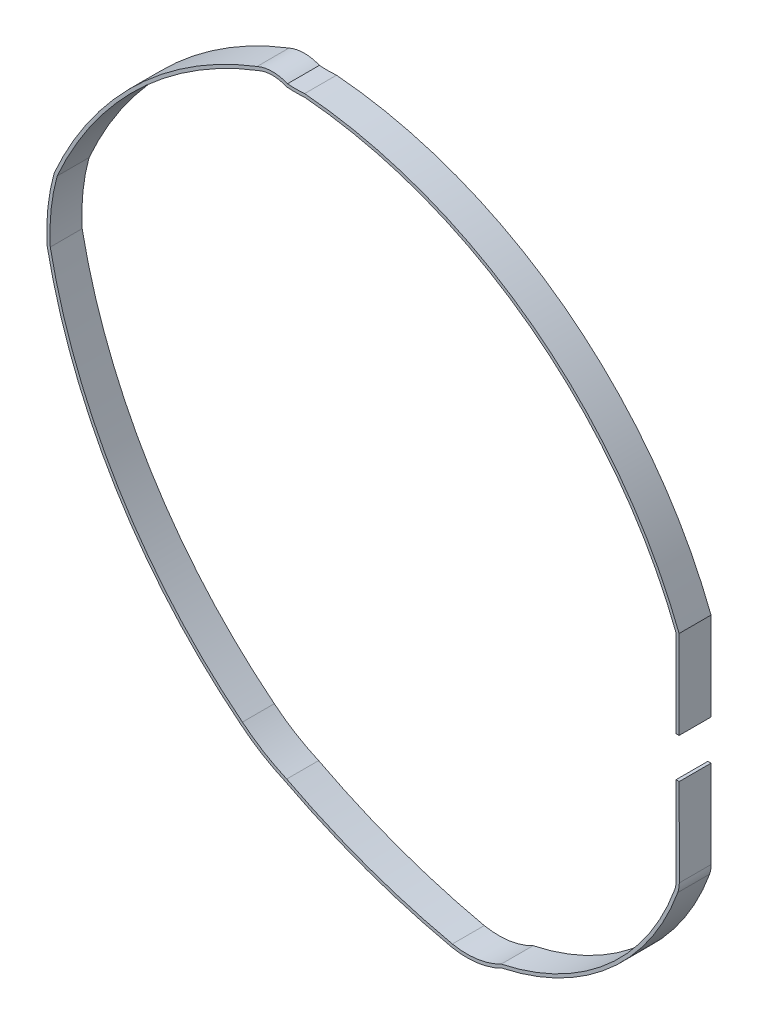
ISO-10303-21;
HEADER;
FILE_DESCRIPTION(('STEP AP214'),'2;1');
FILE_NAME('part.step','',(''),(''),'','','');
FILE_SCHEMA(('AUTOMOTIVE_DESIGN { 1 0 10303 214 1 1 1 1 }'));
ENDSEC;
DATA;
#1=APPLICATION_CONTEXT('core data for automotive mechanical design processes');
#2=APPLICATION_PROTOCOL_DEFINITION('international standard','automotive_design',2000,#1);
#3=PRODUCT_CONTEXT('',#1,'mechanical');
#4=PRODUCT('Part','Part','',(#3));
#5=PRODUCT_RELATED_PRODUCT_CATEGORY('part','',(#4));
#6=PRODUCT_DEFINITION_FORMATION('','',#4);
#7=PRODUCT_DEFINITION_CONTEXT('part definition',#1,'design');
#8=PRODUCT_DEFINITION('design','',#6,#7);
#9=PRODUCT_DEFINITION_SHAPE('','',#8);
#10=(LENGTH_UNIT() NAMED_UNIT(*) SI_UNIT(.MILLI.,.METRE.));
#11=(NAMED_UNIT(*) PLANE_ANGLE_UNIT() SI_UNIT($,.RADIAN.));
#12=(NAMED_UNIT(*) SI_UNIT($,.STERADIAN.) SOLID_ANGLE_UNIT());
#13=UNCERTAINTY_MEASURE_WITH_UNIT(LENGTH_MEASURE(1.E-05),#10,'distance_accuracy_value','');
#14=(GEOMETRIC_REPRESENTATION_CONTEXT(3) GLOBAL_UNCERTAINTY_ASSIGNED_CONTEXT((#13)) GLOBAL_UNIT_ASSIGNED_CONTEXT((#10,
#11,#12)) REPRESENTATION_CONTEXT('',''));
#15=CARTESIAN_POINT('',(0.,0.,0.));
#16=DIRECTION('',(0.,0.,1.));
#17=DIRECTION('',(1.,0.,0.));
#18=AXIS2_PLACEMENT_3D('',#15,#16,#17);
#19=CARTESIAN_POINT('',(32.2426542166612,-64.1730551396362,4.));
#20=DIRECTION('',(-0.999999306327988,-0.00117785548448811,0.));
#21=DIRECTION('',(0.00117785548448811,-0.999999306327988,0.));
#22=AXIS2_PLACEMENT_3D('',#19,#20,#21);
#23=PLANE('',#22);
#24=DIRECTION('',(-0.00117785548448811,0.999999306327988,0.));
#25=VECTOR('',#24,1.);
#26=CARTESIAN_POINT('',(32.2426542166612,-64.1730551396362,0.));
#27=LINE('',#26,#25);
#28=CARTESIAN_POINT('',(32.2426542166612,-64.1730551396362,0.));
#29=VERTEX_POINT('',#28);
#30=CARTESIAN_POINT('',(32.2296978063318,-53.1730627700283,0.));
#31=VERTEX_POINT('',#30);
#32=EDGE_CURVE('E248',#29,#31,#27,.T.);
#33=ORIENTED_EDGE('',*,*,#32,.T.);
#34=DIRECTION('',(0.,0.,-1.));
#35=VECTOR('',#34,1.);
#36=CARTESIAN_POINT('',(32.2296978063318,-53.1730627700283,4.));
#37=LINE('',#36,#35);
#38=CARTESIAN_POINT('',(32.2296978063318,-53.1730627700283,4.));
#39=VERTEX_POINT('',#38);
#40=EDGE_CURVE('E11',#39,#31,#37,.T.);
#41=ORIENTED_EDGE('',*,*,#40,.F.);
#42=DIRECTION('',(-0.00117785548448811,0.999999306327988,0.));
#43=VECTOR('',#42,1.);
#44=CARTESIAN_POINT('',(32.2426542166612,-64.1730551396362,4.));
#45=LINE('',#44,#43);
#46=CARTESIAN_POINT('',(32.2426542166612,-64.1730551396362,4.));
#47=VERTEX_POINT('',#46);
#48=EDGE_CURVE('E149',#47,#39,#45,.T.);
#49=ORIENTED_EDGE('',*,*,#48,.F.);
#50=DIRECTION('',(0.,0.,-1.));
#51=VECTOR('',#50,1.);
#52=CARTESIAN_POINT('',(32.2426542166612,-64.1730551396362,4.));
#53=LINE('',#52,#51);
#54=EDGE_CURVE('E244',#47,#29,#53,.T.);
#55=ORIENTED_EDGE('',*,*,#54,.T.);
#56=EDGE_LOOP('',(#33,#41,#49,#55));
#57=FACE_BOUND('',#56,.T.);
#58=ADVANCED_FACE('F33',(#57),#23,.F.);
#59=CARTESIAN_POINT('',(31.8296980838006,-53.1735339122221,4.));
#60=DIRECTION('',(-0.00117785548450073,0.999999306327988,0.));
#61=DIRECTION('',(-0.999999306327988,-0.00117785548450073,0.));
#62=AXIS2_PLACEMENT_3D('',#59,#60,#61);
#63=PLANE('',#62);
#64=DIRECTION('',(0.999999306327988,0.00117785548450073,0.));
#65=VECTOR('',#64,1.);
#66=CARTESIAN_POINT('',(31.8296980838006,-53.1735339122221,0.));
#67=LINE('',#66,#65);
#68=CARTESIAN_POINT('',(31.8296980838006,-53.1735339122221,0.));
#69=VERTEX_POINT('',#68);
#70=EDGE_CURVE('E251',#69,#31,#67,.T.);
#71=ORIENTED_EDGE('',*,*,#70,.F.);
#72=DIRECTION('',(0.,0.,-1.));
#73=VECTOR('',#72,1.);
#74=CARTESIAN_POINT('',(31.8296980838006,-53.1735339122221,4.));
#75=LINE('',#74,#73);
#76=CARTESIAN_POINT('',(31.8296980838006,-53.1735339122221,4.));
#77=VERTEX_POINT('',#76);
#78=EDGE_CURVE('E41',#77,#69,#75,.T.);
#79=ORIENTED_EDGE('',*,*,#78,.F.);
#80=DIRECTION('',(0.999999306327988,0.00117785548450073,0.));
#81=VECTOR('',#80,1.);
#82=CARTESIAN_POINT('',(31.8296980838006,-53.1735339122221,4.));
#83=LINE('',#82,#81);
#84=EDGE_CURVE('E393',#77,#39,#83,.T.);
#85=ORIENTED_EDGE('',*,*,#84,.T.);
#86=ORIENTED_EDGE('',*,*,#40,.T.);
#87=EDGE_LOOP('',(#71,#79,#85,#86));
#88=FACE_BOUND('',#87,.T.);
#89=ADVANCED_FACE('F380',(#88),#63,.T.);
#90=CARTESIAN_POINT('',(31.84265449413,-64.17352628183,4.));
#91=DIRECTION('',(-0.999999306327988,-0.00117785548448811,0.));
#92=DIRECTION('',(0.00117785548448811,-0.999999306327988,0.));
#93=AXIS2_PLACEMENT_3D('',#90,#91,#92);
#94=PLANE('',#93);
#95=DIRECTION('',(-0.00117785548448811,0.999999306327988,0.));
#96=VECTOR('',#95,1.);
#97=CARTESIAN_POINT('',(31.84265449413,-64.17352628183,0.));
#98=LINE('',#97,#96);
#99=CARTESIAN_POINT('',(31.84265449413,-64.17352628183,0.));
#100=VERTEX_POINT('',#99);
#101=EDGE_CURVE('E254',#100,#69,#98,.T.);
#102=ORIENTED_EDGE('',*,*,#101,.F.);
#103=DIRECTION('',(0.,0.,-1.));
#104=VECTOR('',#103,1.);
#105=CARTESIAN_POINT('',(31.84265449413,-64.17352628183,4.));
#106=LINE('',#105,#104);
#107=CARTESIAN_POINT('',(31.84265449413,-64.17352628183,4.));
#108=VERTEX_POINT('',#107);
#109=EDGE_CURVE('E370',#108,#100,#106,.T.);
#110=ORIENTED_EDGE('',*,*,#109,.F.);
#111=DIRECTION('',(-0.00117785548448811,0.999999306327988,0.));
#112=VECTOR('',#111,1.);
#113=CARTESIAN_POINT('',(31.84265449413,-64.17352628183,4.));
#114=LINE('',#113,#112);
#115=EDGE_CURVE('E377',#108,#77,#114,.T.);
#116=ORIENTED_EDGE('',*,*,#115,.T.);
#117=ORIENTED_EDGE('',*,*,#78,.T.);
#118=EDGE_LOOP('',(#102,#110,#116,#117));
#119=FACE_BOUND('',#118,.T.);
#120=ADVANCED_FACE('F375',(#119),#94,.T.);
#121=CARTESIAN_POINT('',(28.8426565751458,-64.1770598482834,4.));
#122=DIRECTION('',(0.,0.,-1.));
#123=DIRECTION('',(-1.,0.,0.));
#124=AXIS2_PLACEMENT_3D('',#121,#122,#123);
#125=CYLINDRICAL_SURFACE('',#124,3.00000000000022);
#126=CARTESIAN_POINT('',(28.8426565751458,-64.1770598482834,0.));
#127=DIRECTION('',(0.,0.,1.));
#128=DIRECTION('',(-1.,0.,0.));
#129=AXIS2_PLACEMENT_3D('',#126,#127,#128);
#130=CIRCLE('',#129,3.00000000000022);
#131=CARTESIAN_POINT('',(31.6649801349229,-65.1941585278267,0.));
#132=VERTEX_POINT('',#131);
#133=EDGE_CURVE('E257',#132,#100,#130,.T.);
#134=ORIENTED_EDGE('',*,*,#133,.F.);
#135=DIRECTION('',(0.,0.,-1.));
#136=VECTOR('',#135,1.);
#137=CARTESIAN_POINT('',(31.6649801349229,-65.1941585278267,4.));
#138=LINE('',#137,#136);
#139=CARTESIAN_POINT('',(31.6649801349229,-65.1941585278267,4.));
#140=VERTEX_POINT('',#139);
#141=EDGE_CURVE('E368',#140,#132,#138,.T.);
#142=ORIENTED_EDGE('',*,*,#141,.F.);
#143=CARTESIAN_POINT('',(28.8426565751458,-64.1770598482834,4.));
#144=DIRECTION('',(0.,0.,1.));
#145=DIRECTION('',(-1.,0.,0.));
#146=AXIS2_PLACEMENT_3D('',#143,#144,#145);
#147=CIRCLE('',#146,3.00000000000022);
#148=EDGE_CURVE('E390',#140,#108,#147,.T.);
#149=ORIENTED_EDGE('',*,*,#148,.T.);
#150=ORIENTED_EDGE('',*,*,#109,.T.);
#151=EDGE_LOOP('',(#134,#142,#149,#150));
#152=FACE_BOUND('',#151,.T.);
#153=ADVANCED_FACE('F387',(#152),#125,.F.);
#154=CARTESIAN_POINT('',(3.75255400761759,-55.1351801167282,4.));
#155=DIRECTION('',(0.,0.,-1.));
#156=DIRECTION('',(-1.,0.,0.));
#157=AXIS2_PLACEMENT_3D('',#154,#155,#156);
#158=CYLINDRICAL_SURFACE('',#157,29.6696238430355);
#159=CARTESIAN_POINT('',(3.75255400761759,-55.1351801167282,0.));
#160=DIRECTION('',(0.,0.,1.));
#161=DIRECTION('',(-1.,0.,0.));
#162=AXIS2_PLACEMENT_3D('',#159,#160,#161);
#163=CIRCLE('',#162,29.6696238430355);
#164=CARTESIAN_POINT('',(9.91256322862572,-84.158289277952,0.));
#165=VERTEX_POINT('',#164);
#166=EDGE_CURVE('E260',#165,#132,#163,.T.);
#167=ORIENTED_EDGE('',*,*,#166,.F.);
#168=DIRECTION('',(0.,0.,-1.));
#169=VECTOR('',#168,1.);
#170=CARTESIAN_POINT('',(9.91256322862572,-84.158289277952,4.));
#171=LINE('',#170,#169);
#172=CARTESIAN_POINT('',(9.91256322862572,-84.158289277952,4.));
#173=VERTEX_POINT('',#172);
#174=EDGE_CURVE('E366',#173,#165,#171,.T.);
#175=ORIENTED_EDGE('',*,*,#174,.F.);
#176=CARTESIAN_POINT('',(3.75255400761759,-55.1351801167282,4.));
#177=DIRECTION('',(0.,0.,1.));
#178=DIRECTION('',(-1.,0.,0.));
#179=AXIS2_PLACEMENT_3D('',#176,#177,#178);
#180=CIRCLE('',#179,29.6696238430355);
#181=EDGE_CURVE('E395',#173,#140,#180,.T.);
#182=ORIENTED_EDGE('',*,*,#181,.T.);
#183=ORIENTED_EDGE('',*,*,#141,.T.);
#184=EDGE_LOOP('',(#167,#175,#182,#183));
#185=FACE_BOUND('',#184,.T.);
#186=ADVANCED_FACE('F481',(#185),#158,.F.);
#187=CARTESIAN_POINT('',(5.60203262604722,-75.9039146753038,4.));
#188=DIRECTION('',(0.,0.,-1.));
#189=DIRECTION('',(-1.,0.,0.));
#190=AXIS2_PLACEMENT_3D('',#187,#188,#189);
#191=CYLINDRICAL_SURFACE('',#190,9.31210900691185);
#192=CARTESIAN_POINT('',(5.60203262604722,-75.9039146753038,0.));
#193=DIRECTION('',(0.,0.,1.));
#194=DIRECTION('',(1.,0.,0.));
#195=AXIS2_PLACEMENT_3D('',#192,#193,#194);
#196=CIRCLE('',#195,9.31210900691185);
#197=CARTESIAN_POINT('',(3.78571826090459,-85.0371712841803,0.));
#198=VERTEX_POINT('',#197);
#199=EDGE_CURVE('E263',#198,#165,#196,.T.);
#200=ORIENTED_EDGE('',*,*,#199,.F.);
#201=DIRECTION('',(0.,0.,-1.));
#202=VECTOR('',#201,1.);
#203=CARTESIAN_POINT('',(3.78571826090459,-85.0371712841803,4.));
#204=LINE('',#203,#202);
#205=CARTESIAN_POINT('',(3.78571826090459,-85.0371712841803,4.));
#206=VERTEX_POINT('',#205);
#207=EDGE_CURVE('E364',#206,#198,#204,.T.);
#208=ORIENTED_EDGE('',*,*,#207,.F.);
#209=CARTESIAN_POINT('',(5.60203262604722,-75.9039146753038,4.));
#210=DIRECTION('',(0.,0.,1.));
#211=DIRECTION('',(1.,0.,0.));
#212=AXIS2_PLACEMENT_3D('',#209,#210,#211);
#213=CIRCLE('',#212,9.31210900691185);
#214=EDGE_CURVE('E401',#206,#173,#213,.T.);
#215=ORIENTED_EDGE('',*,*,#214,.T.);
#216=ORIENTED_EDGE('',*,*,#174,.T.);
#217=EDGE_LOOP('',(#200,#208,#215,#216));
#218=FACE_BOUND('',#217,.T.);
#219=ADVANCED_FACE('F484',(#218),#191,.F.);
#220=CARTESIAN_POINT('',(21.6708654213609,-3.27432774122798,4.));
#221=DIRECTION('',(0.,0.,-1.));
#222=DIRECTION('',(-1.,0.,0.));
#223=AXIS2_PLACEMENT_3D('',#220,#221,#222);
#224=CYLINDRICAL_SURFACE('',#223,83.6961234059289);
#225=CARTESIAN_POINT('',(21.6708654213609,-3.27432774122798,0.));
#226=DIRECTION('',(0.,0.,1.));
#227=DIRECTION('',(1.,0.,0.));
#228=AXIS2_PLACEMENT_3D('',#225,#226,#227);
#229=CIRCLE('',#228,83.6961234059289);
#230=CARTESIAN_POINT('',(-16.9875040614568,-77.5075517188408,0.));
#231=VERTEX_POINT('',#230);
#232=EDGE_CURVE('E266',#231,#198,#229,.T.);
#233=ORIENTED_EDGE('',*,*,#232,.F.);
#234=DIRECTION('',(0.,0.,-1.));
#235=VECTOR('',#234,1.);
#236=CARTESIAN_POINT('',(-16.9875040614568,-77.5075517188408,4.));
#237=LINE('',#236,#235);
#238=CARTESIAN_POINT('',(-16.9875040614568,-77.5075517188408,4.));
#239=VERTEX_POINT('',#238);
#240=EDGE_CURVE('E362',#239,#231,#237,.T.);
#241=ORIENTED_EDGE('',*,*,#240,.F.);
#242=CARTESIAN_POINT('',(21.6708654213609,-3.27432774122798,4.));
#243=DIRECTION('',(0.,0.,1.));
#244=DIRECTION('',(1.,0.,0.));
#245=AXIS2_PLACEMENT_3D('',#242,#243,#244);
#246=CIRCLE('',#245,83.6961234059289);
#247=EDGE_CURVE('E404',#239,#206,#246,.T.);
#248=ORIENTED_EDGE('',*,*,#247,.T.);
#249=ORIENTED_EDGE('',*,*,#207,.T.);
#250=EDGE_LOOP('',(#233,#241,#248,#249));
#251=FACE_BOUND('',#250,.T.);
#252=ADVANCED_FACE('F488',(#251),#224,.F.);
#253=CARTESIAN_POINT('',(-7.53169654037676,-55.8267358830406,4.));
#254=DIRECTION('',(0.,0.,-1.));
#255=DIRECTION('',(-1.,0.,0.));
#256=AXIS2_PLACEMENT_3D('',#253,#254,#255);
#257=CYLINDRICAL_SURFACE('',#256,23.6531196923704);
#258=CARTESIAN_POINT('',(-7.53169654037676,-55.8267358830406,0.));
#259=DIRECTION('',(0.,0.,1.));
#260=DIRECTION('',(1.,0.,0.));
#261=AXIS2_PLACEMENT_3D('',#258,#259,#260);
#262=CIRCLE('',#261,23.6531196923704);
#263=CARTESIAN_POINT('',(-22.5433942410399,-74.1056582617122,0.));
#264=VERTEX_POINT('',#263);
#265=EDGE_CURVE('E269',#264,#231,#262,.T.);
#266=ORIENTED_EDGE('',*,*,#265,.F.);
#267=DIRECTION('',(0.,0.,-1.));
#268=VECTOR('',#267,1.);
#269=CARTESIAN_POINT('',(-22.5433942410399,-74.1056582617122,4.));
#270=LINE('',#269,#268);
#271=CARTESIAN_POINT('',(-22.5433942410399,-74.1056582617122,4.));
#272=VERTEX_POINT('',#271);
#273=EDGE_CURVE('E360',#272,#264,#270,.T.);
#274=ORIENTED_EDGE('',*,*,#273,.F.);
#275=CARTESIAN_POINT('',(-7.53169654037676,-55.8267358830406,4.));
#276=DIRECTION('',(0.,0.,1.));
#277=DIRECTION('',(1.,0.,0.));
#278=AXIS2_PLACEMENT_3D('',#275,#276,#277);
#279=CIRCLE('',#278,23.6531196923704);
#280=EDGE_CURVE('E407',#272,#239,#279,.T.);
#281=ORIENTED_EDGE('',*,*,#280,.T.);
#282=ORIENTED_EDGE('',*,*,#240,.T.);
#283=EDGE_LOOP('',(#266,#274,#281,#282));
#284=FACE_BOUND('',#283,.T.);
#285=ADVANCED_FACE('F492',(#284),#257,.F.);
#286=CARTESIAN_POINT('',(19.4934477611816,-21.3731292594592,4.));
#287=DIRECTION('',(0.,0.,-1.));
#288=DIRECTION('',(-1.,0.,0.));
#289=AXIS2_PLACEMENT_3D('',#286,#287,#288);
#290=CYLINDRICAL_SURFACE('',#289,67.4374947673265);
#291=CARTESIAN_POINT('',(19.4934477611816,-21.3731292594592,0.));
#292=DIRECTION('',(0.,0.,1.));
#293=DIRECTION('',(1.,0.,0.));
#294=AXIS2_PLACEMENT_3D('',#291,#292,#293);
#295=CIRCLE('',#294,67.4374947673265);
#296=CARTESIAN_POINT('',(-46.6407079031649,-34.5674141986737,0.));
#297=VERTEX_POINT('',#296);
#298=EDGE_CURVE('E272',#297,#264,#295,.T.);
#299=ORIENTED_EDGE('',*,*,#298,.F.);
#300=DIRECTION('',(0.,0.,-1.));
#301=VECTOR('',#300,1.);
#302=CARTESIAN_POINT('',(-46.6407079031649,-34.5674141986737,4.));
#303=LINE('',#302,#301);
#304=CARTESIAN_POINT('',(-46.6407079031649,-34.5674141986737,4.));
#305=VERTEX_POINT('',#304);
#306=EDGE_CURVE('E358',#305,#297,#303,.T.);
#307=ORIENTED_EDGE('',*,*,#306,.F.);
#308=CARTESIAN_POINT('',(19.4934477611816,-21.3731292594592,4.));
#309=DIRECTION('',(0.,0.,1.));
#310=DIRECTION('',(1.,0.,0.));
#311=AXIS2_PLACEMENT_3D('',#308,#309,#310);
#312=CIRCLE('',#311,67.4374947673265);
#313=EDGE_CURVE('E410',#305,#272,#312,.T.);
#314=ORIENTED_EDGE('',*,*,#313,.T.);
#315=ORIENTED_EDGE('',*,*,#273,.T.);
#316=EDGE_LOOP('',(#299,#307,#314,#315));
#317=FACE_BOUND('',#316,.T.);
#318=ADVANCED_FACE('F496',(#317),#290,.F.);
#319=CARTESIAN_POINT('',(-21.4883011659079,-33.1192294709946,4.));
#320=DIRECTION('',(0.,0.,-1.));
#321=DIRECTION('',(-1.,0.,0.));
#322=AXIS2_PLACEMENT_3D('',#319,#320,#321);
#323=CYLINDRICAL_SURFACE('',#322,25.1940628657209);
#324=CARTESIAN_POINT('',(-21.4883011659079,-33.1192294709946,0.));
#325=DIRECTION('',(0.,0.,1.));
#326=DIRECTION('',(1.,0.,0.));
#327=AXIS2_PLACEMENT_3D('',#324,#325,#326);
#328=CIRCLE('',#327,25.1940628657209);
#329=CARTESIAN_POINT('',(-45.7748927313331,-26.41831357717,0.));
#330=VERTEX_POINT('',#329);
#331=EDGE_CURVE('E275',#330,#297,#328,.T.);
#332=ORIENTED_EDGE('',*,*,#331,.F.);
#333=DIRECTION('',(0.,0.,-1.));
#334=VECTOR('',#333,1.);
#335=CARTESIAN_POINT('',(-45.7748927313331,-26.41831357717,4.));
#336=LINE('',#335,#334);
#337=CARTESIAN_POINT('',(-45.7748927313331,-26.41831357717,4.));
#338=VERTEX_POINT('',#337);
#339=EDGE_CURVE('E356',#338,#330,#336,.T.);
#340=ORIENTED_EDGE('',*,*,#339,.F.);
#341=CARTESIAN_POINT('',(-21.4883011659079,-33.1192294709946,4.));
#342=DIRECTION('',(0.,0.,1.));
#343=DIRECTION('',(1.,0.,0.));
#344=AXIS2_PLACEMENT_3D('',#341,#342,#343);
#345=CIRCLE('',#344,25.1940628657209);
#346=EDGE_CURVE('E413',#338,#305,#345,.T.);
#347=ORIENTED_EDGE('',*,*,#346,.T.);
#348=ORIENTED_EDGE('',*,*,#306,.T.);
#349=EDGE_LOOP('',(#332,#340,#347,#348));
#350=FACE_BOUND('',#349,.T.);
#351=ADVANCED_FACE('F500',(#350),#323,.F.);
#352=CARTESIAN_POINT('',(-4.26832410416488,-44.6686753016585,4.));
#353=DIRECTION('',(0.,0.,-1.));
#354=DIRECTION('',(-1.,0.,0.));
#355=AXIS2_PLACEMENT_3D('',#352,#353,#354);
#356=CYLINDRICAL_SURFACE('',#355,45.3417130496467);
#357=CARTESIAN_POINT('',(-4.26832410416488,-44.6686753016585,0.));
#358=DIRECTION('',(0.,0.,1.));
#359=DIRECTION('',(-1.,0.,0.));
#360=AXIS2_PLACEMENT_3D('',#357,#358,#359);
#361=CIRCLE('',#360,45.3417130496467);
#362=CARTESIAN_POINT('',(-20.550670416233,-2.3513485802034,0.));
#363=VERTEX_POINT('',#362);
#364=EDGE_CURVE('E278',#363,#330,#361,.T.);
#365=ORIENTED_EDGE('',*,*,#364,.F.);
#366=DIRECTION('',(0.,0.,-1.));
#367=VECTOR('',#366,1.);
#368=CARTESIAN_POINT('',(-20.550670416233,-2.3513485802034,4.));
#369=LINE('',#368,#367);
#370=CARTESIAN_POINT('',(-20.550670416233,-2.3513485802034,4.));
#371=VERTEX_POINT('',#370);
#372=EDGE_CURVE('E354',#371,#363,#369,.T.);
#373=ORIENTED_EDGE('',*,*,#372,.F.);
#374=CARTESIAN_POINT('',(-4.26832410416488,-44.6686753016585,4.));
#375=DIRECTION('',(0.,0.,1.));
#376=DIRECTION('',(-1.,0.,0.));
#377=AXIS2_PLACEMENT_3D('',#374,#375,#376);
#378=CIRCLE('',#377,45.3417130496467);
#379=EDGE_CURVE('E416',#371,#338,#378,.T.);
#380=ORIENTED_EDGE('',*,*,#379,.T.);
#381=ORIENTED_EDGE('',*,*,#339,.T.);
#382=EDGE_LOOP('',(#365,#373,#380,#381));
#383=FACE_BOUND('',#382,.T.);
#384=ADVANCED_FACE('F504',(#383),#356,.F.);
#385=CARTESIAN_POINT('',(-18.7690872388449,-6.4047799586133,4.));
#386=DIRECTION('',(0.,0.,-1.));
#387=DIRECTION('',(-1.,0.,0.));
#388=AXIS2_PLACEMENT_3D('',#385,#386,#387);
#389=CYLINDRICAL_SURFACE('',#388,4.42767936479488);
#390=CARTESIAN_POINT('',(-18.7690872388449,-6.4047799586133,0.));
#391=DIRECTION('',(0.,0.,1.));
#392=DIRECTION('',(1.,0.,0.));
#393=AXIS2_PLACEMENT_3D('',#390,#391,#392);
#394=CIRCLE('',#393,4.42767936479488);
#395=CARTESIAN_POINT('',(-16.9875040614568,-2.3513485802034,0.));
#396=VERTEX_POINT('',#395);
#397=EDGE_CURVE('E281',#396,#363,#394,.T.);
#398=ORIENTED_EDGE('',*,*,#397,.F.);
#399=DIRECTION('',(0.,0.,-1.));
#400=VECTOR('',#399,1.);
#401=CARTESIAN_POINT('',(-16.9875040614568,-2.3513485802034,4.));
#402=LINE('',#401,#400);
#403=CARTESIAN_POINT('',(-16.9875040614568,-2.3513485802034,4.));
#404=VERTEX_POINT('',#403);
#405=EDGE_CURVE('E352',#404,#396,#402,.T.);
#406=ORIENTED_EDGE('',*,*,#405,.F.);
#407=CARTESIAN_POINT('',(-18.7690872388449,-6.4047799586133,4.));
#408=DIRECTION('',(0.,0.,1.));
#409=DIRECTION('',(1.,0.,0.));
#410=AXIS2_PLACEMENT_3D('',#407,#408,#409);
#411=CIRCLE('',#410,4.42767936479488);
#412=EDGE_CURVE('E419',#404,#371,#411,.T.);
#413=ORIENTED_EDGE('',*,*,#412,.T.);
#414=ORIENTED_EDGE('',*,*,#372,.T.);
#415=EDGE_LOOP('',(#398,#406,#413,#414));
#416=FACE_BOUND('',#415,.T.);
#417=ADVANCED_FACE('F508',(#416),#389,.F.);
#418=CARTESIAN_POINT('',(-15.8658633970027,11.9920088416571,4.));
#419=DIRECTION('',(0.,0.,-1.));
#420=DIRECTION('',(-1.,0.,0.));
#421=AXIS2_PLACEMENT_3D('',#418,#419,#420);
#422=CYLINDRICAL_SURFACE('',#421,14.3871463435734);
#423=CARTESIAN_POINT('',(-15.8658633970027,11.9920088416571,0.));
#424=DIRECTION('',(0.,0.,-1.));
#425=DIRECTION('',(1.,0.,0.));
#426=AXIS2_PLACEMENT_3D('',#423,#424,#425);
#427=CIRCLE('',#426,14.3871463435734);
#428=CARTESIAN_POINT('',(-14.7442227325486,-2.3513485802034,0.));
#429=VERTEX_POINT('',#428);
#430=EDGE_CURVE('E284',#429,#396,#427,.T.);
#431=ORIENTED_EDGE('',*,*,#430,.F.);
#432=DIRECTION('',(0.,0.,-1.));
#433=VECTOR('',#432,1.);
#434=CARTESIAN_POINT('',(-14.7442227325486,-2.3513485802034,4.));
#435=LINE('',#434,#433);
#436=CARTESIAN_POINT('',(-14.7442227325486,-2.3513485802034,4.));
#437=VERTEX_POINT('',#436);
#438=EDGE_CURVE('E350',#437,#429,#435,.T.);
#439=ORIENTED_EDGE('',*,*,#438,.F.);
#440=CARTESIAN_POINT('',(-15.8658633970027,11.9920088416571,4.));
#441=DIRECTION('',(0.,0.,-1.));
#442=DIRECTION('',(1.,0.,0.));
#443=AXIS2_PLACEMENT_3D('',#440,#441,#442);
#444=CIRCLE('',#443,14.3871463435734);
#445=EDGE_CURVE('E422',#437,#404,#444,.T.);
#446=ORIENTED_EDGE('',*,*,#445,.T.);
#447=ORIENTED_EDGE('',*,*,#405,.T.);
#448=EDGE_LOOP('',(#431,#439,#446,#447));
#449=FACE_BOUND('',#448,.T.);
#450=ADVANCED_FACE('F512',(#449),#422,.T.);
#451=CARTESIAN_POINT('',(-19.3787315362177,-57.0873106740458,4.));
#452=DIRECTION('',(0.,0.,-1.));
#453=DIRECTION('',(-1.,0.,0.));
#454=AXIS2_PLACEMENT_3D('',#451,#452,#453);
#455=CYLINDRICAL_SURFACE('',#454,54.9318142626824);
#456=CARTESIAN_POINT('',(-19.3787315362177,-57.0873106740458,0.));
#457=DIRECTION('',(0.,0.,1.));
#458=DIRECTION('',(-1.,0.,0.));
#459=AXIS2_PLACEMENT_3D('',#456,#457,#458);
#460=CIRCLE('',#459,54.9318142626824);
#461=CARTESIAN_POINT('',(31.8179189321097,-37.1773333005341,0.));
#462=VERTEX_POINT('',#461);
#463=EDGE_CURVE('E287',#462,#429,#460,.T.);
#464=ORIENTED_EDGE('',*,*,#463,.F.);
#465=DIRECTION('',(0.,0.,-1.));
#466=VECTOR('',#465,1.);
#467=CARTESIAN_POINT('',(31.8179189321097,-37.1773333005341,4.));
#468=LINE('',#467,#466);
#469=CARTESIAN_POINT('',(31.8179189321097,-37.1773333005341,4.));
#470=VERTEX_POINT('',#469);
#471=EDGE_CURVE('E348',#470,#462,#468,.T.);
#472=ORIENTED_EDGE('',*,*,#471,.F.);
#473=CARTESIAN_POINT('',(-19.3787315362177,-57.0873106740458,4.));
#474=DIRECTION('',(0.,0.,1.));
#475=DIRECTION('',(-1.,0.,0.));
#476=AXIS2_PLACEMENT_3D('',#473,#474,#475);
#477=CIRCLE('',#476,54.9318142626824);
#478=EDGE_CURVE('E425',#470,#437,#477,.T.);
#479=ORIENTED_EDGE('',*,*,#478,.T.);
#480=ORIENTED_EDGE('',*,*,#438,.T.);
#481=EDGE_LOOP('',(#464,#472,#479,#480));
#482=FACE_BOUND('',#481,.T.);
#483=ADVANCED_FACE('F516',(#482),#455,.F.);
#484=CARTESIAN_POINT('',(31.8179189321097,-48.1773333005341,4.));
#485=DIRECTION('',(-1.,0.,0.));
#486=DIRECTION('',(0.,-1.,0.));
#487=AXIS2_PLACEMENT_3D('',#484,#485,#486);
#488=PLANE('',#487);
#489=DIRECTION('',(0.,1.,0.));
#490=VECTOR('',#489,1.);
#491=CARTESIAN_POINT('',(31.8179189321097,-48.1773333005341,0.));
#492=LINE('',#491,#490);
#493=CARTESIAN_POINT('',(31.8179189321097,-48.1773333005341,0.));
#494=VERTEX_POINT('',#493);
#495=EDGE_CURVE('E290',#494,#462,#492,.T.);
#496=ORIENTED_EDGE('',*,*,#495,.F.);
#497=DIRECTION('',(0.,0.,-1.));
#498=VECTOR('',#497,1.);
#499=CARTESIAN_POINT('',(31.8179189321097,-48.1773333005341,4.));
#500=LINE('',#499,#498);
#501=CARTESIAN_POINT('',(31.8179189321097,-48.1773333005341,4.));
#502=VERTEX_POINT('',#501);
#503=EDGE_CURVE('E346',#502,#494,#500,.T.);
#504=ORIENTED_EDGE('',*,*,#503,.F.);
#505=DIRECTION('',(0.,1.,0.));
#506=VECTOR('',#505,1.);
#507=CARTESIAN_POINT('',(31.8179189321097,-48.1773333005341,4.));
#508=LINE('',#507,#506);
#509=EDGE_CURVE('E428',#502,#470,#508,.T.);
#510=ORIENTED_EDGE('',*,*,#509,.T.);
#511=ORIENTED_EDGE('',*,*,#471,.T.);
#512=EDGE_LOOP('',(#496,#504,#510,#511));
#513=FACE_BOUND('',#512,.T.);
#514=ADVANCED_FACE('F520',(#513),#488,.T.);
#515=CARTESIAN_POINT('',(32.2179189321097,-48.1773333005341,4.));
#516=DIRECTION('',(0.,-1.,0.));
#517=DIRECTION('',(0.,0.,-1.));
#518=AXIS2_PLACEMENT_3D('',#515,#516,#517);
#519=PLANE('',#518);
#520=DIRECTION('',(-1.,0.,0.));
#521=VECTOR('',#520,1.);
#522=CARTESIAN_POINT('',(32.2179189321097,-48.1773333005341,0.));
#523=LINE('',#522,#521);
#524=CARTESIAN_POINT('',(32.2179189321097,-48.1773333005341,0.));
#525=VERTEX_POINT('',#524);
#526=EDGE_CURVE('E293',#525,#494,#523,.T.);
#527=ORIENTED_EDGE('',*,*,#526,.F.);
#528=DIRECTION('',(0.,0.,-1.));
#529=VECTOR('',#528,1.);
#530=CARTESIAN_POINT('',(32.2179189321097,-48.1773333005341,4.));
#531=LINE('',#530,#529);
#532=CARTESIAN_POINT('',(32.2179189321097,-48.1773333005341,4.));
#533=VERTEX_POINT('',#532);
#534=EDGE_CURVE('E344',#533,#525,#531,.T.);
#535=ORIENTED_EDGE('',*,*,#534,.F.);
#536=DIRECTION('',(-1.,0.,0.));
#537=VECTOR('',#536,1.);
#538=CARTESIAN_POINT('',(32.2179189321097,-48.1773333005341,4.));
#539=LINE('',#538,#537);
#540=EDGE_CURVE('E431',#533,#502,#539,.T.);
#541=ORIENTED_EDGE('',*,*,#540,.T.);
#542=ORIENTED_EDGE('',*,*,#503,.T.);
#543=EDGE_LOOP('',(#527,#535,#541,#542));
#544=FACE_BOUND('',#543,.T.);
#545=ADVANCED_FACE('F524',(#544),#519,.T.);
#546=CARTESIAN_POINT('',(32.2179189321097,-48.1773333005341,4.));
#547=DIRECTION('',(-1.,0.,0.));
#548=DIRECTION('',(0.,-1.,0.));
#549=AXIS2_PLACEMENT_3D('',#546,#547,#548);
#550=PLANE('',#549);
#551=DIRECTION('',(0.,1.,0.));
#552=VECTOR('',#551,1.);
#553=CARTESIAN_POINT('',(32.2179189321097,-48.1773333005341,0.));
#554=LINE('',#553,#552);
#555=CARTESIAN_POINT('',(32.2179189321097,-37.1024331400394,0.));
#556=VERTEX_POINT('',#555);
#557=EDGE_CURVE('E296',#525,#556,#554,.T.);
#558=ORIENTED_EDGE('',*,*,#557,.T.);
#559=DIRECTION('',(0.,0.,-1.));
#560=VECTOR('',#559,1.);
#561=CARTESIAN_POINT('',(32.2179189321097,-37.1024331400394,4.));
#562=LINE('',#561,#560);
#563=CARTESIAN_POINT('',(32.2179189321097,-37.1024331400394,4.));
#564=VERTEX_POINT('',#563);
#565=EDGE_CURVE('E341',#564,#556,#562,.T.);
#566=ORIENTED_EDGE('',*,*,#565,.F.);
#567=DIRECTION('',(0.,1.,0.));
#568=VECTOR('',#567,1.);
#569=CARTESIAN_POINT('',(32.2179189321097,-48.1773333005341,4.));
#570=LINE('',#569,#568);
#571=EDGE_CURVE('E434',#533,#564,#570,.T.);
#572=ORIENTED_EDGE('',*,*,#571,.F.);
#573=ORIENTED_EDGE('',*,*,#534,.T.);
#574=EDGE_LOOP('',(#558,#566,#572,#573));
#575=FACE_BOUND('',#574,.T.);
#576=ADVANCED_FACE('F528',(#575),#550,.F.);
#577=CARTESIAN_POINT('',(-19.3787315362177,-57.0873106740458,4.));
#578=DIRECTION('',(0.,0.,-1.));
#579=DIRECTION('',(-1.,0.,0.));
#580=AXIS2_PLACEMENT_3D('',#577,#578,#579);
#581=CYLINDRICAL_SURFACE('',#580,55.3318142626824);
#582=CARTESIAN_POINT('',(-19.3787315362177,-57.0873106740458,0.));
#583=DIRECTION('',(0.,0.,1.));
#584=DIRECTION('',(1.,0.,0.));
#585=AXIS2_PLACEMENT_3D('',#582,#583,#584);
#586=CIRCLE('',#585,55.3318142626824);
#587=CARTESIAN_POINT('',(-14.7432224371602,-1.95001181934547,0.));
#588=VERTEX_POINT('',#587);
#589=EDGE_CURVE('E298',#556,#588,#586,.T.);
#590=ORIENTED_EDGE('',*,*,#589,.T.);
#591=DIRECTION('',(0.,0.,-1.));
#592=VECTOR('',#591,1.);
#593=CARTESIAN_POINT('',(-14.7432224371602,-1.95001181934547,4.));
#594=LINE('',#593,#592);
#595=CARTESIAN_POINT('',(-14.7432224371602,-1.95001181934547,4.));
#596=VERTEX_POINT('',#595);
#597=EDGE_CURVE('E338',#596,#588,#594,.T.);
#598=ORIENTED_EDGE('',*,*,#597,.F.);
#599=CARTESIAN_POINT('',(-19.3787315362177,-57.0873106740458,4.));
#600=DIRECTION('',(0.,0.,1.));
#601=DIRECTION('',(1.,0.,0.));
#602=AXIS2_PLACEMENT_3D('',#599,#600,#601);
#603=CIRCLE('',#602,55.3318142626824);
#604=EDGE_CURVE('E436',#564,#596,#603,.T.);
#605=ORIENTED_EDGE('',*,*,#604,.F.);
#606=ORIENTED_EDGE('',*,*,#565,.T.);
#607=EDGE_LOOP('',(#590,#598,#605,#606));
#608=FACE_BOUND('',#607,.T.);
#609=ADVANCED_FACE('F532',(#608),#581,.T.);
#610=CARTESIAN_POINT('',(-15.8658633970027,11.9920088416571,4.));
#611=DIRECTION('',(0.,0.,-1.));
#612=DIRECTION('',(-1.,0.,0.));
#613=AXIS2_PLACEMENT_3D('',#610,#611,#612);
#614=CYLINDRICAL_SURFACE('',#613,13.9871463435734);
#615=CARTESIAN_POINT('',(-15.8658633970027,11.9920088416571,0.));
#616=DIRECTION('',(0.,0.,1.));
#617=DIRECTION('',(1.,0.,0.));
#618=AXIS2_PLACEMENT_3D('',#615,#616,#617);
#619=CIRCLE('',#618,13.9871463435734);
#620=CARTESIAN_POINT('',(-16.8906274111381,-1.9575474793114,0.));
#621=VERTEX_POINT('',#620);
#622=EDGE_CURVE('E300',#588,#621,#619,.F.);
#623=ORIENTED_EDGE('',*,*,#622,.T.);
#624=DIRECTION('',(0.,0.,-1.));
#625=VECTOR('',#624,1.);
#626=CARTESIAN_POINT('',(-16.8906274111381,-1.9575474793114,4.));
#627=LINE('',#626,#625);
#628=CARTESIAN_POINT('',(-16.8906274111381,-1.9575474793114,4.));
#629=VERTEX_POINT('',#628);
#630=EDGE_CURVE('E335',#629,#621,#627,.T.);
#631=ORIENTED_EDGE('',*,*,#630,.F.);
#632=CARTESIAN_POINT('',(-15.8658633970027,11.9920088416571,4.));
#633=DIRECTION('',(0.,0.,1.));
#634=DIRECTION('',(1.,0.,0.));
#635=AXIS2_PLACEMENT_3D('',#632,#633,#634);
#636=CIRCLE('',#635,13.9871463435734);
#637=EDGE_CURVE('E438',#596,#629,#636,.F.);
#638=ORIENTED_EDGE('',*,*,#637,.F.);
#639=ORIENTED_EDGE('',*,*,#597,.T.);
#640=EDGE_LOOP('',(#623,#631,#638,#639));
#641=FACE_BOUND('',#640,.T.);
#642=ADVANCED_FACE('F536',(#641),#614,.F.);
#643=CARTESIAN_POINT('',(-18.7690872388449,-6.4047799586133,4.));
#644=DIRECTION('',(0.,0.,-1.));
#645=DIRECTION('',(-1.,0.,0.));
#646=AXIS2_PLACEMENT_3D('',#643,#644,#645);
#647=CYLINDRICAL_SURFACE('',#646,4.82767936479488);
#648=CARTESIAN_POINT('',(-18.7690872388449,-6.4047799586133,0.));
#649=DIRECTION('',(0.,0.,1.));
#650=DIRECTION('',(1.,0.,0.));
#651=AXIS2_PLACEMENT_3D('',#648,#649,#650);
#652=CIRCLE('',#651,4.82767936479488);
#653=CARTESIAN_POINT('',(-20.7028790928372,-1.98132688271216,0.));
#654=VERTEX_POINT('',#653);
#655=EDGE_CURVE('E302',#621,#654,#652,.T.);
#656=ORIENTED_EDGE('',*,*,#655,.T.);
#657=DIRECTION('',(0.,0.,-1.));
#658=VECTOR('',#657,1.);
#659=CARTESIAN_POINT('',(-20.7028790928372,-1.98132688271216,4.));
#660=LINE('',#659,#658);
#661=CARTESIAN_POINT('',(-20.7028790928372,-1.98132688271216,4.));
#662=VERTEX_POINT('',#661);
#663=EDGE_CURVE('E332',#662,#654,#660,.T.);
#664=ORIENTED_EDGE('',*,*,#663,.F.);
#665=CARTESIAN_POINT('',(-18.7690872388449,-6.4047799586133,4.));
#666=DIRECTION('',(0.,0.,1.));
#667=DIRECTION('',(1.,0.,0.));
#668=AXIS2_PLACEMENT_3D('',#665,#666,#667);
#669=CIRCLE('',#668,4.82767936479488);
#670=EDGE_CURVE('E440',#629,#662,#669,.T.);
#671=ORIENTED_EDGE('',*,*,#670,.F.);
#672=ORIENTED_EDGE('',*,*,#630,.T.);
#673=EDGE_LOOP('',(#656,#664,#671,#672));
#674=FACE_BOUND('',#673,.T.);
#675=ADVANCED_FACE('F540',(#674),#647,.T.);
#676=CARTESIAN_POINT('',(-4.26832410416488,-44.6686753016585,4.));
#677=DIRECTION('',(0.,0.,-1.));
#678=DIRECTION('',(-1.,0.,0.));
#679=AXIS2_PLACEMENT_3D('',#676,#677,#678);
#680=CYLINDRICAL_SURFACE('',#679,45.7417130496467);
#681=CARTESIAN_POINT('',(-4.26832410416488,-44.6686753016585,0.));
#682=DIRECTION('',(0.,0.,1.));
#683=DIRECTION('',(1.,0.,0.));
#684=AXIS2_PLACEMENT_3D('',#681,#682,#683);
#685=CIRCLE('',#684,45.7417130496467);
#686=CARTESIAN_POINT('',(-46.1527268891194,-26.2838686378964,0.));
#687=VERTEX_POINT('',#686);
#688=EDGE_CURVE('E304',#654,#687,#685,.T.);
#689=ORIENTED_EDGE('',*,*,#688,.T.);
#690=DIRECTION('',(0.,0.,-1.));
#691=VECTOR('',#690,1.);
#692=CARTESIAN_POINT('',(-46.1527268891194,-26.2838686378964,4.));
#693=LINE('',#692,#691);
#694=CARTESIAN_POINT('',(-46.1527268891194,-26.2838686378964,4.));
#695=VERTEX_POINT('',#694);
#696=EDGE_CURVE('E329',#695,#687,#693,.T.);
#697=ORIENTED_EDGE('',*,*,#696,.F.);
#698=CARTESIAN_POINT('',(-4.26832410416488,-44.6686753016585,4.));
#699=DIRECTION('',(0.,0.,1.));
#700=DIRECTION('',(1.,0.,0.));
#701=AXIS2_PLACEMENT_3D('',#698,#699,#700);
#702=CIRCLE('',#701,45.7417130496467);
#703=EDGE_CURVE('E442',#662,#695,#702,.T.);
#704=ORIENTED_EDGE('',*,*,#703,.F.);
#705=ORIENTED_EDGE('',*,*,#663,.T.);
#706=EDGE_LOOP('',(#689,#697,#704,#705));
#707=FACE_BOUND('',#706,.T.);
#708=ADVANCED_FACE('F544',(#707),#680,.T.);
#709=CARTESIAN_POINT('',(-21.4883011659079,-33.1192294709946,4.));
#710=DIRECTION('',(0.,0.,-1.));
#711=DIRECTION('',(-1.,0.,0.));
#712=AXIS2_PLACEMENT_3D('',#709,#710,#711);
#713=CYLINDRICAL_SURFACE('',#712,25.5940628657209);
#714=CARTESIAN_POINT('',(-21.4883011659079,-33.1192294709946,0.));
#715=DIRECTION('',(0.,0.,1.));
#716=DIRECTION('',(1.,0.,0.));
#717=AXIS2_PLACEMENT_3D('',#714,#715,#716);
#718=CIRCLE('',#717,25.5940628657209);
#719=CARTESIAN_POINT('',(-47.0384220630514,-34.618354587794,0.));
#720=VERTEX_POINT('',#719);
#721=EDGE_CURVE('E306',#687,#720,#718,.T.);
#722=ORIENTED_EDGE('',*,*,#721,.T.);
#723=DIRECTION('',(0.,0.,-1.));
#724=VECTOR('',#723,1.);
#725=CARTESIAN_POINT('',(-47.0384220630514,-34.618354587794,4.));
#726=LINE('',#725,#724);
#727=CARTESIAN_POINT('',(-47.0384220630514,-34.618354587794,4.));
#728=VERTEX_POINT('',#727);
#729=EDGE_CURVE('E326',#728,#720,#726,.T.);
#730=ORIENTED_EDGE('',*,*,#729,.F.);
#731=CARTESIAN_POINT('',(-21.4883011659079,-33.1192294709946,4.));
#732=DIRECTION('',(0.,0.,1.));
#733=DIRECTION('',(1.,0.,0.));
#734=AXIS2_PLACEMENT_3D('',#731,#732,#733);
#735=CIRCLE('',#734,25.5940628657209);
#736=EDGE_CURVE('E444',#695,#728,#735,.T.);
#737=ORIENTED_EDGE('',*,*,#736,.F.);
#738=ORIENTED_EDGE('',*,*,#696,.T.);
#739=EDGE_LOOP('',(#722,#730,#737,#738));
#740=FACE_BOUND('',#739,.T.);
#741=ADVANCED_FACE('F548',(#740),#713,.T.);
#742=CARTESIAN_POINT('',(19.4934477611816,-21.3731292594592,4.));
#743=DIRECTION('',(0.,0.,-1.));
#744=DIRECTION('',(-1.,0.,0.));
#745=AXIS2_PLACEMENT_3D('',#742,#743,#744);
#746=CYLINDRICAL_SURFACE('',#745,67.8374947673265);
#747=CARTESIAN_POINT('',(19.4934477611816,-21.3731292594592,0.));
#748=DIRECTION('',(0.,0.,1.));
#749=DIRECTION('',(1.,0.,0.));
#750=AXIS2_PLACEMENT_3D('',#747,#748,#749);
#751=CIRCLE('',#750,67.8374947673265);
#752=CARTESIAN_POINT('',(-22.7950024742159,-74.4166271927155,0.));
#753=VERTEX_POINT('',#752);
#754=EDGE_CURVE('E308',#720,#753,#751,.T.);
#755=ORIENTED_EDGE('',*,*,#754,.T.);
#756=DIRECTION('',(0.,0.,-1.));
#757=VECTOR('',#756,1.);
#758=CARTESIAN_POINT('',(-22.7950024742159,-74.4166271927155,4.));
#759=LINE('',#758,#757);
#760=CARTESIAN_POINT('',(-22.7950024742159,-74.4166271927155,4.));
#761=VERTEX_POINT('',#760);
#762=EDGE_CURVE('E323',#761,#753,#759,.T.);
#763=ORIENTED_EDGE('',*,*,#762,.F.);
#764=CARTESIAN_POINT('',(19.4934477611816,-21.3731292594592,4.));
#765=DIRECTION('',(0.,0.,1.));
#766=DIRECTION('',(1.,0.,0.));
#767=AXIS2_PLACEMENT_3D('',#764,#765,#766);
#768=CIRCLE('',#767,67.8374947673265);
#769=EDGE_CURVE('E446',#728,#761,#768,.T.);
#770=ORIENTED_EDGE('',*,*,#769,.F.);
#771=ORIENTED_EDGE('',*,*,#729,.T.);
#772=EDGE_LOOP('',(#755,#763,#770,#771));
#773=FACE_BOUND('',#772,.T.);
#774=ADVANCED_FACE('F552',(#773),#746,.T.);
#775=CARTESIAN_POINT('',(-7.53169654037676,-55.8267358830406,4.));
#776=DIRECTION('',(0.,0.,-1.));
#777=DIRECTION('',(-1.,0.,0.));
#778=AXIS2_PLACEMENT_3D('',#775,#776,#777);
#779=CYLINDRICAL_SURFACE('',#778,24.0531196923704);
#780=CARTESIAN_POINT('',(-7.53169654037676,-55.8267358830406,0.));
#781=DIRECTION('',(0.,0.,1.));
#782=DIRECTION('',(1.,0.,0.));
#783=AXIS2_PLACEMENT_3D('',#780,#781,#782);
#784=CIRCLE('',#783,24.0531196923704);
#785=CARTESIAN_POINT('',(-17.1600766445669,-77.8686700882034,0.));
#786=VERTEX_POINT('',#785);
#787=EDGE_CURVE('E310',#753,#786,#784,.T.);
#788=ORIENTED_EDGE('',*,*,#787,.T.);
#789=DIRECTION('',(0.,0.,-1.));
#790=VECTOR('',#789,1.);
#791=CARTESIAN_POINT('',(-17.1600766445669,-77.8686700882034,4.));
#792=LINE('',#791,#790);
#793=CARTESIAN_POINT('',(-17.1600766445669,-77.8686700882034,4.));
#794=VERTEX_POINT('',#793);
#795=EDGE_CURVE('E320',#794,#786,#792,.T.);
#796=ORIENTED_EDGE('',*,*,#795,.F.);
#797=CARTESIAN_POINT('',(-7.53169654037676,-55.8267358830406,4.));
#798=DIRECTION('',(0.,0.,1.));
#799=DIRECTION('',(1.,0.,0.));
#800=AXIS2_PLACEMENT_3D('',#797,#798,#799);
#801=CIRCLE('',#800,24.0531196923704);
#802=EDGE_CURVE('E448',#761,#794,#801,.T.);
#803=ORIENTED_EDGE('',*,*,#802,.F.);
#804=ORIENTED_EDGE('',*,*,#762,.T.);
#805=EDGE_LOOP('',(#788,#796,#803,#804));
#806=FACE_BOUND('',#805,.T.);
#807=ADVANCED_FACE('F454',(#806),#779,.T.);
#808=CARTESIAN_POINT('',(21.6708654213609,-3.27432774122798,4.));
#809=DIRECTION('',(0.,0.,-1.));
#810=DIRECTION('',(-1.,0.,0.));
#811=AXIS2_PLACEMENT_3D('',#808,#809,#810);
#812=CYLINDRICAL_SURFACE('',#811,84.0961234059289);
#813=CARTESIAN_POINT('',(21.6708654213609,-3.27432774122798,0.));
#814=DIRECTION('',(0.,0.,1.));
#815=DIRECTION('',(1.,0.,0.));
#816=AXIS2_PLACEMENT_3D('',#813,#814,#815);
#817=CIRCLE('',#816,84.0961234059289);
#818=CARTESIAN_POINT('',(3.70392814796982,-85.4287380727449,0.));
#819=VERTEX_POINT('',#818);
#820=EDGE_CURVE('E312',#786,#819,#817,.T.);
#821=ORIENTED_EDGE('',*,*,#820,.T.);
#822=DIRECTION('',(0.,0.,-1.));
#823=VECTOR('',#822,1.);
#824=CARTESIAN_POINT('',(3.70392814796982,-85.4287380727449,4.));
#825=LINE('',#824,#823);
#826=CARTESIAN_POINT('',(3.70392814796982,-85.4287380727449,4.));
#827=VERTEX_POINT('',#826);
#828=EDGE_CURVE('E239',#827,#819,#825,.T.);
#829=ORIENTED_EDGE('',*,*,#828,.F.);
#830=CARTESIAN_POINT('',(21.6708654213609,-3.27432774122798,4.));
#831=DIRECTION('',(0.,0.,1.));
#832=DIRECTION('',(1.,0.,0.));
#833=AXIS2_PLACEMENT_3D('',#830,#831,#832);
#834=CIRCLE('',#833,84.0961234059289);
#835=EDGE_CURVE('E230',#794,#827,#834,.T.);
#836=ORIENTED_EDGE('',*,*,#835,.F.);
#837=ORIENTED_EDGE('',*,*,#795,.T.);
#838=EDGE_LOOP('',(#821,#829,#836,#837));
#839=FACE_BOUND('',#838,.T.);
#840=ADVANCED_FACE('F458',(#839),#812,.T.);
#841=CARTESIAN_POINT('',(5.60203262604722,-75.9039146753038,4.));
#842=DIRECTION('',(0.,0.,-1.));
#843=DIRECTION('',(-1.,0.,0.));
#844=AXIS2_PLACEMENT_3D('',#841,#842,#843);
#845=CYLINDRICAL_SURFACE('',#844,9.71210900691185);
#846=CARTESIAN_POINT('',(5.60203262604722,-75.9039146753038,0.));
#847=DIRECTION('',(0.,0.,1.));
#848=DIRECTION('',(1.,0.,0.));
#849=AXIS2_PLACEMENT_3D('',#846,#847,#848);
#850=CIRCLE('',#849,9.71210900691185);
#851=CARTESIAN_POINT('',(10.0487720842683,-84.5382397533188,0.));
#852=VERTEX_POINT('',#851);
#853=EDGE_CURVE('E238',#819,#852,#850,.T.);
#854=ORIENTED_EDGE('',*,*,#853,.T.);
#855=DIRECTION('',(0.,0.,-1.));
#856=VECTOR('',#855,1.);
#857=CARTESIAN_POINT('',(10.0487720842683,-84.5382397533188,4.));
#858=LINE('',#857,#856);
#859=CARTESIAN_POINT('',(10.0487720842683,-84.5382397533188,4.));
#860=VERTEX_POINT('',#859);
#861=EDGE_CURVE('E235',#860,#852,#858,.T.);
#862=ORIENTED_EDGE('',*,*,#861,.F.);
#863=CARTESIAN_POINT('',(5.60203262604722,-75.9039146753038,4.));
#864=DIRECTION('',(0.,0.,1.));
#865=DIRECTION('',(1.,0.,0.));
#866=AXIS2_PLACEMENT_3D('',#863,#864,#865);
#867=CIRCLE('',#866,9.71210900691185);
#868=EDGE_CURVE('E224',#827,#860,#867,.T.);
#869=ORIENTED_EDGE('',*,*,#868,.F.);
#870=ORIENTED_EDGE('',*,*,#828,.T.);
#871=EDGE_LOOP('',(#854,#862,#869,#870));
#872=FACE_BOUND('',#871,.T.);
#873=ADVANCED_FACE('F236',(#872),#845,.T.);
#874=CARTESIAN_POINT('',(3.75255400761759,-55.1351801167282,4.));
#875=DIRECTION('',(0.,0.,-1.));
#876=DIRECTION('',(-1.,0.,0.));
#877=AXIS2_PLACEMENT_3D('',#874,#875,#876);
#878=CYLINDRICAL_SURFACE('',#877,30.0696238430355);
#879=CARTESIAN_POINT('',(3.75255400761759,-55.1351801167282,0.));
#880=DIRECTION('',(0.,0.,1.));
#881=DIRECTION('',(1.,0.,0.));
#882=AXIS2_PLACEMENT_3D('',#879,#880,#881);
#883=CIRCLE('',#882,30.0696238430355);
#884=CARTESIAN_POINT('',(32.0412899428931,-65.3297716850991,0.));
#885=VERTEX_POINT('',#884);
#886=EDGE_CURVE('E137',#852,#885,#883,.T.);
#887=ORIENTED_EDGE('',*,*,#886,.T.);
#888=DIRECTION('',(0.,0.,-1.));
#889=VECTOR('',#888,1.);
#890=CARTESIAN_POINT('',(32.0412899428931,-65.3297716850991,4.));
#891=LINE('',#890,#889);
#892=CARTESIAN_POINT('',(32.0412899428931,-65.3297716850991,4.));
#893=VERTEX_POINT('',#892);
#894=EDGE_CURVE('E240',#893,#885,#891,.T.);
#895=ORIENTED_EDGE('',*,*,#894,.F.);
#896=CARTESIAN_POINT('',(3.75255400761759,-55.1351801167282,4.));
#897=DIRECTION('',(0.,0.,1.));
#898=DIRECTION('',(1.,0.,0.));
#899=AXIS2_PLACEMENT_3D('',#896,#897,#898);
#900=CIRCLE('',#899,30.0696238430355);
#901=EDGE_CURVE('E228',#860,#893,#900,.T.);
#902=ORIENTED_EDGE('',*,*,#901,.F.);
#903=ORIENTED_EDGE('',*,*,#861,.T.);
#904=EDGE_LOOP('',(#887,#895,#902,#903));
#905=FACE_BOUND('',#904,.T.);
#906=ADVANCED_FACE('F242',(#905),#878,.T.);
#907=CARTESIAN_POINT('',(28.8426565751458,-64.1770598482834,4.));
#908=DIRECTION('',(0.,0.,-1.));
#909=DIRECTION('',(-1.,0.,0.));
#910=AXIS2_PLACEMENT_3D('',#907,#908,#909);
#911=CYLINDRICAL_SURFACE('',#910,3.40000000000022);
#912=CARTESIAN_POINT('',(28.8426565751458,-64.1770598482834,0.));
#913=DIRECTION('',(0.,0.,1.));
#914=DIRECTION('',(1.,0.,0.));
#915=AXIS2_PLACEMENT_3D('',#912,#913,#914);
#916=CIRCLE('',#915,3.40000000000022);
#917=EDGE_CURVE('E143',#885,#29,#916,.T.);
#918=ORIENTED_EDGE('',*,*,#917,.T.);
#919=ORIENTED_EDGE('',*,*,#54,.F.);
#920=CARTESIAN_POINT('',(28.8426565751458,-64.1770598482834,4.));
#921=DIRECTION('',(0.,0.,1.));
#922=DIRECTION('',(1.,0.,0.));
#923=AXIS2_PLACEMENT_3D('',#920,#921,#922);
#924=CIRCLE('',#923,3.40000000000022);
#925=EDGE_CURVE('E49',#893,#47,#924,.T.);
#926=ORIENTED_EDGE('',*,*,#925,.F.);
#927=ORIENTED_EDGE('',*,*,#894,.T.);
#928=EDGE_LOOP('',(#918,#919,#926,#927));
#929=FACE_BOUND('',#928,.T.);
#930=ADVANCED_FACE('F460',(#929),#911,.T.);
#931=CARTESIAN_POINT('',(28.8426565751458,-64.1770598482834,4.));
#932=DIRECTION('',(0.,0.,1.));
#933=DIRECTION('',(1.,0.,0.));
#934=AXIS2_PLACEMENT_3D('',#931,#932,#933);
#935=PLANE('',#934);
#936=ORIENTED_EDGE('',*,*,#48,.T.);
#937=ORIENTED_EDGE('',*,*,#84,.F.);
#938=ORIENTED_EDGE('',*,*,#115,.F.);
#939=ORIENTED_EDGE('',*,*,#148,.F.);
#940=ORIENTED_EDGE('',*,*,#181,.F.);
#941=ORIENTED_EDGE('',*,*,#214,.F.);
#942=ORIENTED_EDGE('',*,*,#247,.F.);
#943=ORIENTED_EDGE('',*,*,#280,.F.);
#944=ORIENTED_EDGE('',*,*,#313,.F.);
#945=ORIENTED_EDGE('',*,*,#346,.F.);
#946=ORIENTED_EDGE('',*,*,#379,.F.);
#947=ORIENTED_EDGE('',*,*,#412,.F.);
#948=ORIENTED_EDGE('',*,*,#445,.F.);
#949=ORIENTED_EDGE('',*,*,#478,.F.);
#950=ORIENTED_EDGE('',*,*,#509,.F.);
#951=ORIENTED_EDGE('',*,*,#540,.F.);
#952=ORIENTED_EDGE('',*,*,#571,.T.);
#953=ORIENTED_EDGE('',*,*,#604,.T.);
#954=ORIENTED_EDGE('',*,*,#637,.T.);
#955=ORIENTED_EDGE('',*,*,#670,.T.);
#956=ORIENTED_EDGE('',*,*,#703,.T.);
#957=ORIENTED_EDGE('',*,*,#736,.T.);
#958=ORIENTED_EDGE('',*,*,#769,.T.);
#959=ORIENTED_EDGE('',*,*,#802,.T.);
#960=ORIENTED_EDGE('',*,*,#835,.T.);
#961=ORIENTED_EDGE('',*,*,#868,.T.);
#962=ORIENTED_EDGE('',*,*,#901,.T.);
#963=ORIENTED_EDGE('',*,*,#925,.T.);
#964=EDGE_LOOP('',(#936,#937,#938,#939,#940,#941,#942,#943,#944,#945,#946,#947,#948,#949,#950,
#951,#952,#953,#954,#955,#956,#957,#958,#959,#960,#961,#962,#963));
#965=FACE_BOUND('',#964,.T.);
#966=ADVANCED_FACE('F226',(#965),#935,.T.);
#967=CARTESIAN_POINT('',(28.8426565751458,-64.1770598482834,0.));
#968=DIRECTION('',(0.,0.,1.));
#969=DIRECTION('',(1.,0.,0.));
#970=AXIS2_PLACEMENT_3D('',#967,#968,#969);
#971=PLANE('',#970);
#972=ORIENTED_EDGE('',*,*,#32,.F.);
#973=ORIENTED_EDGE('',*,*,#917,.F.);
#974=ORIENTED_EDGE('',*,*,#886,.F.);
#975=ORIENTED_EDGE('',*,*,#853,.F.);
#976=ORIENTED_EDGE('',*,*,#820,.F.);
#977=ORIENTED_EDGE('',*,*,#787,.F.);
#978=ORIENTED_EDGE('',*,*,#754,.F.);
#979=ORIENTED_EDGE('',*,*,#721,.F.);
#980=ORIENTED_EDGE('',*,*,#688,.F.);
#981=ORIENTED_EDGE('',*,*,#655,.F.);
#982=ORIENTED_EDGE('',*,*,#622,.F.);
#983=ORIENTED_EDGE('',*,*,#589,.F.);
#984=ORIENTED_EDGE('',*,*,#557,.F.);
#985=ORIENTED_EDGE('',*,*,#526,.T.);
#986=ORIENTED_EDGE('',*,*,#495,.T.);
#987=ORIENTED_EDGE('',*,*,#463,.T.);
#988=ORIENTED_EDGE('',*,*,#430,.T.);
#989=ORIENTED_EDGE('',*,*,#397,.T.);
#990=ORIENTED_EDGE('',*,*,#364,.T.);
#991=ORIENTED_EDGE('',*,*,#331,.T.);
#992=ORIENTED_EDGE('',*,*,#298,.T.);
#993=ORIENTED_EDGE('',*,*,#265,.T.);
#994=ORIENTED_EDGE('',*,*,#232,.T.);
#995=ORIENTED_EDGE('',*,*,#199,.T.);
#996=ORIENTED_EDGE('',*,*,#166,.T.);
#997=ORIENTED_EDGE('',*,*,#133,.T.);
#998=ORIENTED_EDGE('',*,*,#101,.T.);
#999=ORIENTED_EDGE('',*,*,#70,.T.);
#1000=EDGE_LOOP('',(#972,#973,#974,#975,#976,#977,#978,#979,#980,#981,#982,#983,#984,#985,#986,
#987,#988,#989,#990,#991,#992,#993,#994,#995,#996,#997,#998,#999));
#1001=FACE_BOUND('',#1000,.T.);
#1002=ADVANCED_FACE('F383',(#1001),#971,.F.);
#1003=CLOSED_SHELL('',(#58,#89,#120,#153,#186,#219,#252,#285,#318,#351,#384,#417,#450,#483,#514,
#545,#576,#609,#642,#675,#708,#741,#774,#807,#840,#873,#906,#930,#966,#1002));
#1004=MANIFOLD_SOLID_BREP('B2',#1003);
#1005=ADVANCED_BREP_SHAPE_REPRESENTATION('',(#18,#1004),#14);
#1006=SHAPE_DEFINITION_REPRESENTATION(#9,#1005);
ENDSEC;
END-ISO-10303-21;
